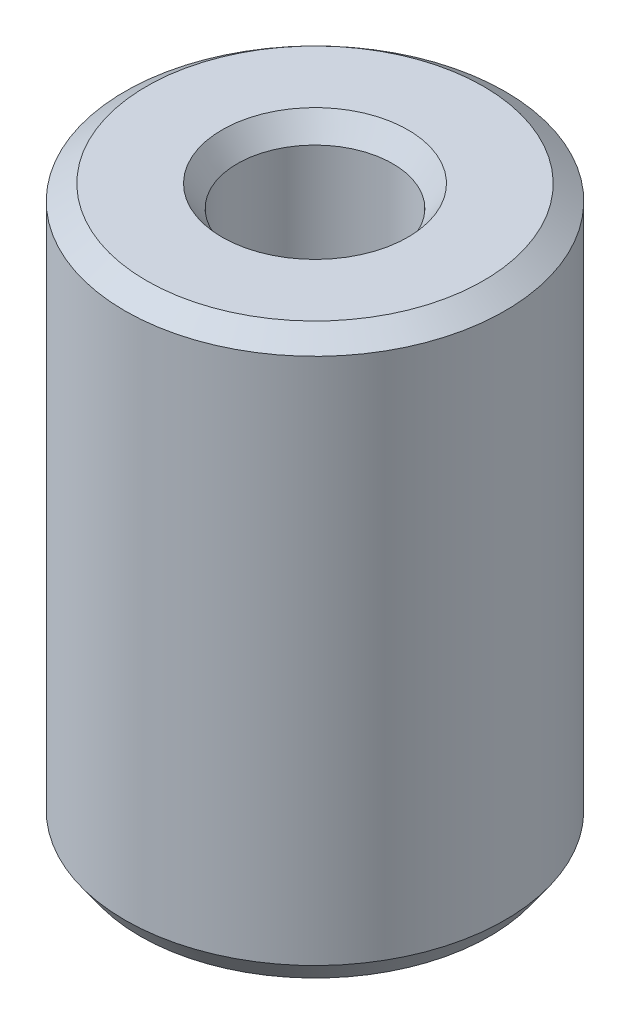
ISO-10303-21;
HEADER;
FILE_DESCRIPTION(('STEP AP214'),'2;1');
FILE_NAME('part.step','',(''),(''),'','','');
FILE_SCHEMA(('AUTOMOTIVE_DESIGN { 1 0 10303 214 1 1 1 1 }'));
ENDSEC;
DATA;
#1=APPLICATION_CONTEXT('core data for automotive mechanical design processes');
#2=APPLICATION_PROTOCOL_DEFINITION('international standard','automotive_design',2000,#1);
#3=PRODUCT_CONTEXT('',#1,'mechanical');
#4=PRODUCT('Part','Part','',(#3));
#5=PRODUCT_RELATED_PRODUCT_CATEGORY('part','',(#4));
#6=PRODUCT_DEFINITION_FORMATION('','',#4);
#7=PRODUCT_DEFINITION_CONTEXT('part definition',#1,'design');
#8=PRODUCT_DEFINITION('design','',#6,#7);
#9=PRODUCT_DEFINITION_SHAPE('','',#8);
#10=(LENGTH_UNIT() NAMED_UNIT(*) SI_UNIT(.MILLI.,.METRE.));
#11=(NAMED_UNIT(*) PLANE_ANGLE_UNIT() SI_UNIT($,.RADIAN.));
#12=(NAMED_UNIT(*) SI_UNIT($,.STERADIAN.) SOLID_ANGLE_UNIT());
#13=UNCERTAINTY_MEASURE_WITH_UNIT(LENGTH_MEASURE(1.E-05),#10,'distance_accuracy_value','');
#14=(GEOMETRIC_REPRESENTATION_CONTEXT(3) GLOBAL_UNCERTAINTY_ASSIGNED_CONTEXT((#13)) GLOBAL_UNIT_ASSIGNED_CONTEXT((#10,
#11,#12)) REPRESENTATION_CONTEXT('',''));
#15=CARTESIAN_POINT('',(0.,0.,0.));
#16=DIRECTION('',(0.,0.,1.));
#17=DIRECTION('',(1.,0.,0.));
#18=AXIS2_PLACEMENT_3D('',#15,#16,#17);
#19=CARTESIAN_POINT('',(0.,44.5514417465045,0.));
#20=DIRECTION('',(0.,-1.,0.));
#21=DIRECTION('',(0.,0.,-1.));
#22=AXIS2_PLACEMENT_3D('',#19,#20,#21);
#23=CYLINDRICAL_SURFACE('',#22,15.);
#24=CARTESIAN_POINT('',(0.,1.70744334773189,0.));
#25=DIRECTION('',(0.,1.,0.));
#26=DIRECTION('',(0.,0.,1.));
#27=AXIS2_PLACEMENT_3D('',#24,#25,#26);
#28=CIRCLE('',#27,15.);
#29=CARTESIAN_POINT('',(0.,1.70744334773189,15.));
#30=VERTEX_POINT('',#29);
#31=EDGE_CURVE('E10',#30,#30,#28,.T.);
#32=ORIENTED_EDGE('',*,*,#31,.T.);
#33=EDGE_LOOP('',(#32));
#34=FACE_BOUND('',#33,.T.);
#35=CARTESIAN_POINT('',(0.,43.3457510289462,0.));
#36=DIRECTION('',(0.,1.,0.));
#37=DIRECTION('',(0.,0.,1.));
#38=AXIS2_PLACEMENT_3D('',#35,#36,#37);
#39=CIRCLE('',#38,15.);
#40=CARTESIAN_POINT('',(0.,43.3457510289462,15.));
#41=VERTEX_POINT('',#40);
#42=EDGE_CURVE('E50',#41,#41,#39,.F.);
#43=ORIENTED_EDGE('',*,*,#42,.T.);
#44=EDGE_LOOP('',(#43));
#45=FACE_BOUND('',#44,.T.);
#46=ADVANCED_FACE('F39',(#34,#45),#23,.T.);
#47=CARTESIAN_POINT('',(0.,44.5514417465045,0.));
#48=DIRECTION('',(0.,1.,0.));
#49=DIRECTION('',(0.,0.,1.));
#50=AXIS2_PLACEMENT_3D('',#47,#48,#49);
#51=PLANE('',#50);
#52=CARTESIAN_POINT('',(0.,44.5514417465045,0.));
#53=DIRECTION('',(0.,1.,0.));
#54=DIRECTION('',(0.,0.,1.));
#55=AXIS2_PLACEMENT_3D('',#52,#53,#54);
#56=CIRCLE('',#55,7.3393699359706);
#57=CARTESIAN_POINT('',(0.,44.5514417465045,7.3393699359706));
#58=VERTEX_POINT('',#57);
#59=EDGE_CURVE('E58',#58,#58,#56,.F.);
#60=ORIENTED_EDGE('',*,*,#59,.T.);
#61=EDGE_LOOP('',(#60));
#62=FACE_BOUND('',#61,.T.);
#63=CARTESIAN_POINT('',(0.,44.5514417465045,0.));
#64=DIRECTION('',(0.,1.,0.));
#65=DIRECTION('',(0.,0.,1.));
#66=AXIS2_PLACEMENT_3D('',#63,#64,#65);
#67=CIRCLE('',#66,13.2925566522681);
#68=CARTESIAN_POINT('',(0.,44.5514417465045,13.2925566522681));
#69=VERTEX_POINT('',#68);
#70=EDGE_CURVE('E61',#69,#69,#67,.T.);
#71=ORIENTED_EDGE('',*,*,#70,.T.);
#72=EDGE_LOOP('',(#71));
#73=FACE_BOUND('',#72,.T.);
#74=ADVANCED_FACE('F88',(#62,#73),#51,.T.);
#75=CARTESIAN_POINT('',(0.,0.,0.));
#76=DIRECTION('',(0.,1.,0.));
#77=DIRECTION('',(0.,0.,1.));
#78=AXIS2_PLACEMENT_3D('',#75,#76,#77);
#79=PLANE('',#78);
#80=CARTESIAN_POINT('',(0.,0.,0.));
#81=DIRECTION('',(0.,1.,0.));
#82=DIRECTION('',(0.,0.,1.));
#83=AXIS2_PLACEMENT_3D('',#80,#81,#82);
#84=CIRCLE('',#83,7.84112256614422);
#85=CARTESIAN_POINT('',(0.,0.,7.84112256614422));
#86=VERTEX_POINT('',#85);
#87=EDGE_CURVE('E51',#86,#86,#84,.T.);
#88=ORIENTED_EDGE('',*,*,#87,.T.);
#89=EDGE_LOOP('',(#88));
#90=FACE_BOUND('',#89,.T.);
#91=CARTESIAN_POINT('',(0.,0.,0.));
#92=DIRECTION('',(0.,1.,0.));
#93=DIRECTION('',(0.,0.,1.));
#94=AXIS2_PLACEMENT_3D('',#91,#92,#93);
#95=CIRCLE('',#94,13.7943092824417);
#96=CARTESIAN_POINT('',(0.,0.,13.7943092824417));
#97=VERTEX_POINT('',#96);
#98=EDGE_CURVE('E54',#97,#97,#95,.F.);
#99=ORIENTED_EDGE('',*,*,#98,.T.);
#100=EDGE_LOOP('',(#99));
#101=FACE_BOUND('',#100,.T.);
#102=ADVANCED_FACE('F83',(#90,#101),#79,.F.);
#103=CARTESIAN_POINT('',(0.,44.5514417465045,0.));
#104=DIRECTION('',(0.,-1.,0.));
#105=DIRECTION('',(0.,0.,-1.));
#106=AXIS2_PLACEMENT_3D('',#103,#104,#105);
#107=CYLINDRICAL_SURFACE('',#106,6.13367921841232);
#108=CARTESIAN_POINT('',(0.,42.8439983987726,0.));
#109=DIRECTION('',(0.,1.,0.));
#110=DIRECTION('',(0.,0.,1.));
#111=AXIS2_PLACEMENT_3D('',#108,#109,#110);
#112=CIRCLE('',#111,6.13367921841232);
#113=CARTESIAN_POINT('',(0.,42.8439983987726,6.13367921841232));
#114=VERTEX_POINT('',#113);
#115=EDGE_CURVE('E67',#114,#114,#112,.T.);
#116=ORIENTED_EDGE('',*,*,#115,.T.);
#117=EDGE_LOOP('',(#116));
#118=FACE_BOUND('',#117,.T.);
#119=CARTESIAN_POINT('',(0.,1.20569071755828,0.));
#120=DIRECTION('',(0.,1.,0.));
#121=DIRECTION('',(0.,0.,1.));
#122=AXIS2_PLACEMENT_3D('',#119,#120,#121);
#123=CIRCLE('',#122,6.13367921841232);
#124=CARTESIAN_POINT('',(0.,1.20569071755828,6.13367921841232));
#125=VERTEX_POINT('',#124);
#126=EDGE_CURVE('E69',#125,#125,#123,.F.);
#127=ORIENTED_EDGE('',*,*,#126,.T.);
#128=EDGE_LOOP('',(#127));
#129=FACE_BOUND('',#128,.T.);
#130=ADVANCED_FACE('F71',(#118,#129),#107,.F.);
#131=CARTESIAN_POINT('',(0.,42.8439983987726,0.));
#132=DIRECTION('',(0.,1.,0.));
#133=DIRECTION('',(0.,0.,1.));
#134=AXIS2_PLACEMENT_3D('',#131,#132,#133);
#135=CONICAL_SURFACE('',#134,6.13367921841232,0.614833593499566);
#136=ORIENTED_EDGE('',*,*,#59,.F.);
#137=EDGE_LOOP('',(#136));
#138=FACE_BOUND('',#137,.T.);
#139=ORIENTED_EDGE('',*,*,#115,.F.);
#140=EDGE_LOOP('',(#139));
#141=FACE_BOUND('',#140,.T.);
#142=ADVANCED_FACE('F77',(#138,#141),#135,.F.);
#143=CARTESIAN_POINT('',(0.,0.,0.));
#144=DIRECTION('',(0.,-1.,0.));
#145=DIRECTION('',(0.,0.,-1.));
#146=AXIS2_PLACEMENT_3D('',#143,#144,#145);
#147=CONICAL_SURFACE('',#146,7.84112256614422,0.955962733295329);
#148=ORIENTED_EDGE('',*,*,#126,.F.);
#149=EDGE_LOOP('',(#148));
#150=FACE_BOUND('',#149,.T.);
#151=ORIENTED_EDGE('',*,*,#87,.F.);
#152=EDGE_LOOP('',(#151));
#153=FACE_BOUND('',#152,.T.);
#154=ADVANCED_FACE('F73',(#150,#153),#147,.F.);
#155=CARTESIAN_POINT('',(0.,1.70744334773189,0.));
#156=DIRECTION('',(0.,1.,0.));
#157=DIRECTION('',(0.,0.,1.));
#158=AXIS2_PLACEMENT_3D('',#155,#156,#157);
#159=CONICAL_SURFACE('',#158,15.,0.614833593499564);
#160=ORIENTED_EDGE('',*,*,#98,.F.);
#161=EDGE_LOOP('',(#160));
#162=FACE_BOUND('',#161,.T.);
#163=ORIENTED_EDGE('',*,*,#31,.F.);
#164=EDGE_LOOP('',(#163));
#165=FACE_BOUND('',#164,.T.);
#166=ADVANCED_FACE('F76',(#162,#165),#159,.T.);
#167=CARTESIAN_POINT('',(0.,44.5514417465045,0.));
#168=DIRECTION('',(0.,-1.,0.));
#169=DIRECTION('',(0.,0.,-1.));
#170=AXIS2_PLACEMENT_3D('',#167,#168,#169);
#171=CONICAL_SURFACE('',#170,13.2925566522681,0.955962733295332);
#172=ORIENTED_EDGE('',*,*,#42,.F.);
#173=EDGE_LOOP('',(#172));
#174=FACE_BOUND('',#173,.T.);
#175=ORIENTED_EDGE('',*,*,#70,.F.);
#176=EDGE_LOOP('',(#175));
#177=FACE_BOUND('',#176,.T.);
#178=ADVANCED_FACE('F45',(#174,#177),#171,.T.);
#179=CLOSED_SHELL('',(#46,#74,#102,#130,#142,#154,#166,#178));
#180=MANIFOLD_SOLID_BREP('B2',#179);
#181=ADVANCED_BREP_SHAPE_REPRESENTATION('',(#18,#180),#14);
#182=SHAPE_DEFINITION_REPRESENTATION(#9,#181);
ENDSEC;
END-ISO-10303-21;
